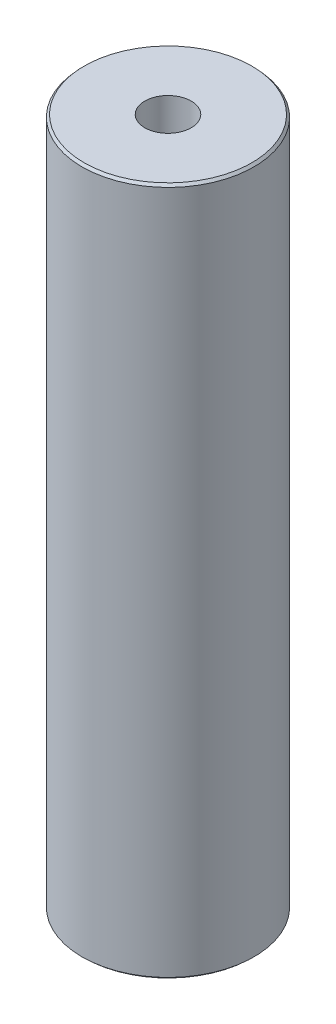
ISO-10303-21;
HEADER;
FILE_DESCRIPTION(('STEP AP214'),'2;1');
FILE_NAME('part.step','',(''),(''),'','','');
FILE_SCHEMA(('AUTOMOTIVE_DESIGN { 1 0 10303 214 1 1 1 1 }'));
ENDSEC;
DATA;
#1=APPLICATION_CONTEXT('core data for automotive mechanical design processes');
#2=APPLICATION_PROTOCOL_DEFINITION('international standard','automotive_design',2000,#1);
#3=PRODUCT_CONTEXT('',#1,'mechanical');
#4=PRODUCT('Part','Part','',(#3));
#5=PRODUCT_RELATED_PRODUCT_CATEGORY('part','',(#4));
#6=PRODUCT_DEFINITION_FORMATION('','',#4);
#7=PRODUCT_DEFINITION_CONTEXT('part definition',#1,'design');
#8=PRODUCT_DEFINITION('design','',#6,#7);
#9=PRODUCT_DEFINITION_SHAPE('','',#8);
#10=(LENGTH_UNIT() NAMED_UNIT(*) SI_UNIT(.MILLI.,.METRE.));
#11=(NAMED_UNIT(*) PLANE_ANGLE_UNIT() SI_UNIT($,.RADIAN.));
#12=(NAMED_UNIT(*) SI_UNIT($,.STERADIAN.) SOLID_ANGLE_UNIT());
#13=UNCERTAINTY_MEASURE_WITH_UNIT(LENGTH_MEASURE(1.E-05),#10,'distance_accuracy_value','');
#14=(GEOMETRIC_REPRESENTATION_CONTEXT(3) GLOBAL_UNCERTAINTY_ASSIGNED_CONTEXT((#13)) GLOBAL_UNIT_ASSIGNED_CONTEXT((#10,
#11,#12)) REPRESENTATION_CONTEXT('',''));
#15=CARTESIAN_POINT('',(0.,0.,0.));
#16=DIRECTION('',(0.,0.,1.));
#17=DIRECTION('',(1.,0.,0.));
#18=AXIS2_PLACEMENT_3D('',#15,#16,#17);
#19=CARTESIAN_POINT('',(0.,80.0774158411905,0.));
#20=DIRECTION('',(0.,-1.,0.));
#21=DIRECTION('',(0.,0.,-1.));
#22=AXIS2_PLACEMENT_3D('',#19,#20,#21);
#23=CYLINDRICAL_SURFACE('',#22,10.);
#24=CARTESIAN_POINT('',(0.,79.7950956363443,0.));
#25=DIRECTION('',(0.,1.,0.));
#26=DIRECTION('',(0.,0.,1.));
#27=AXIS2_PLACEMENT_3D('',#24,#25,#26);
#28=CIRCLE('',#27,10.);
#29=CARTESIAN_POINT('',(0.,79.7950956363443,10.));
#30=VERTEX_POINT('',#29);
#31=EDGE_CURVE('E50',#30,#30,#28,.F.);
#32=ORIENTED_EDGE('',*,*,#31,.T.);
#33=EDGE_LOOP('',(#32));
#34=FACE_BOUND('',#33,.T.);
#35=CARTESIAN_POINT('',(0.,0.254884933255761,0.));
#36=DIRECTION('',(0.,1.,0.));
#37=DIRECTION('',(0.,0.,1.));
#38=AXIS2_PLACEMENT_3D('',#35,#36,#37);
#39=CIRCLE('',#38,10.);
#40=CARTESIAN_POINT('',(0.,0.254884933255761,10.));
#41=VERTEX_POINT('',#40);
#42=EDGE_CURVE('E51',#41,#41,#39,.T.);
#43=ORIENTED_EDGE('',*,*,#42,.T.);
#44=EDGE_LOOP('',(#43));
#45=FACE_BOUND('',#44,.T.);
#46=ADVANCED_FACE('F39',(#34,#45),#23,.T.);
#47=CARTESIAN_POINT('',(0.,80.0774158411905,0.));
#48=DIRECTION('',(0.,1.,0.));
#49=DIRECTION('',(0.,0.,1.));
#50=AXIS2_PLACEMENT_3D('',#47,#48,#49);
#51=PLANE('',#50);
#52=CARTESIAN_POINT('',(0.,80.0774158411905,0.));
#53=DIRECTION('',(0.,1.,0.));
#54=DIRECTION('',(0.,0.,1.));
#55=AXIS2_PLACEMENT_3D('',#52,#53,#54);
#56=CIRCLE('',#55,9.74511506674423);
#57=CARTESIAN_POINT('',(0.,80.0774158411905,9.74511506674423));
#58=VERTEX_POINT('',#57);
#59=EDGE_CURVE('E54',#58,#58,#56,.T.);
#60=ORIENTED_EDGE('',*,*,#59,.T.);
#61=EDGE_LOOP('',(#60));
#62=FACE_BOUND('',#61,.T.);
#63=CARTESIAN_POINT('',(0.,80.0774158411905,0.));
#64=DIRECTION('',(0.,1.,0.));
#65=DIRECTION('',(0.,0.,1.));
#66=AXIS2_PLACEMENT_3D('',#63,#64,#65);
#67=CIRCLE('',#66,2.69724789662016);
#68=CARTESIAN_POINT('',(0.,80.0774158411905,2.69724789662016));
#69=VERTEX_POINT('',#68);
#70=EDGE_CURVE('E58',#69,#69,#67,.T.);
#71=ORIENTED_EDGE('',*,*,#70,.F.);
#72=EDGE_LOOP('',(#71));
#73=FACE_BOUND('',#72,.T.);
#74=ADVANCED_FACE('F69',(#62,#73),#51,.T.);
#75=CARTESIAN_POINT('',(0.,0.,0.));
#76=DIRECTION('',(0.,1.,0.));
#77=DIRECTION('',(0.,0.,1.));
#78=AXIS2_PLACEMENT_3D('',#75,#76,#77);
#79=PLANE('',#78);
#80=CARTESIAN_POINT('',(0.,0.,0.));
#81=DIRECTION('',(0.,1.,0.));
#82=DIRECTION('',(0.,0.,1.));
#83=AXIS2_PLACEMENT_3D('',#80,#81,#82);
#84=CIRCLE('',#83,9.71767979515371);
#85=CARTESIAN_POINT('',(0.,0.,9.71767979515371));
#86=VERTEX_POINT('',#85);
#87=EDGE_CURVE('E10',#86,#86,#84,.F.);
#88=ORIENTED_EDGE('',*,*,#87,.T.);
#89=EDGE_LOOP('',(#88));
#90=FACE_BOUND('',#89,.T.);
#91=CARTESIAN_POINT('',(0.,0.,0.));
#92=DIRECTION('',(0.,1.,0.));
#93=DIRECTION('',(0.,0.,1.));
#94=AXIS2_PLACEMENT_3D('',#91,#92,#93);
#95=CIRCLE('',#94,2.69724789662016);
#96=CARTESIAN_POINT('',(0.,0.,2.69724789662016));
#97=VERTEX_POINT('',#96);
#98=EDGE_CURVE('E63',#97,#97,#95,.T.);
#99=ORIENTED_EDGE('',*,*,#98,.T.);
#100=EDGE_LOOP('',(#99));
#101=FACE_BOUND('',#100,.T.);
#102=ADVANCED_FACE('F75',(#90,#101),#79,.F.);
#103=CARTESIAN_POINT('',(0.,80.0774158411905,0.));
#104=DIRECTION('',(0.,-1.,0.));
#105=DIRECTION('',(0.,0.,-1.));
#106=AXIS2_PLACEMENT_3D('',#103,#104,#105);
#107=CYLINDRICAL_SURFACE('',#106,2.69724789662016);
#108=ORIENTED_EDGE('',*,*,#70,.T.);
#109=EDGE_LOOP('',(#108));
#110=FACE_BOUND('',#109,.T.);
#111=ORIENTED_EDGE('',*,*,#98,.F.);
#112=EDGE_LOOP('',(#111));
#113=FACE_BOUND('',#112,.T.);
#114=ADVANCED_FACE('F70',(#110,#113),#107,.F.);
#115=CARTESIAN_POINT('',(0.,80.0774158411905,0.));
#116=DIRECTION('',(0.,-1.,0.));
#117=DIRECTION('',(0.,0.,-1.));
#118=AXIS2_PLACEMENT_3D('',#115,#116,#117);
#119=CONICAL_SURFACE('',#118,9.74511506674423,0.73437211240632);
#120=ORIENTED_EDGE('',*,*,#31,.F.);
#121=EDGE_LOOP('',(#120));
#122=FACE_BOUND('',#121,.T.);
#123=ORIENTED_EDGE('',*,*,#59,.F.);
#124=EDGE_LOOP('',(#123));
#125=FACE_BOUND('',#124,.T.);
#126=ADVANCED_FACE('F81',(#122,#125),#119,.T.);
#127=CARTESIAN_POINT('',(0.,0.254884933255761,0.));
#128=DIRECTION('',(0.,1.,0.));
#129=DIRECTION('',(0.,0.,1.));
#130=AXIS2_PLACEMENT_3D('',#127,#128,#129);
#131=CONICAL_SURFACE('',#130,10.,0.836424214388583);
#132=ORIENTED_EDGE('',*,*,#87,.F.);
#133=EDGE_LOOP('',(#132));
#134=FACE_BOUND('',#133,.T.);
#135=ORIENTED_EDGE('',*,*,#42,.F.);
#136=EDGE_LOOP('',(#135));
#137=FACE_BOUND('',#136,.T.);
#138=ADVANCED_FACE('F45',(#134,#137),#131,.T.);
#139=CLOSED_SHELL('',(#46,#74,#102,#114,#126,#138));
#140=MANIFOLD_SOLID_BREP('B2',#139);
#141=ADVANCED_BREP_SHAPE_REPRESENTATION('',(#18,#140),#14);
#142=SHAPE_DEFINITION_REPRESENTATION(#9,#141);
ENDSEC;
END-ISO-10303-21;
